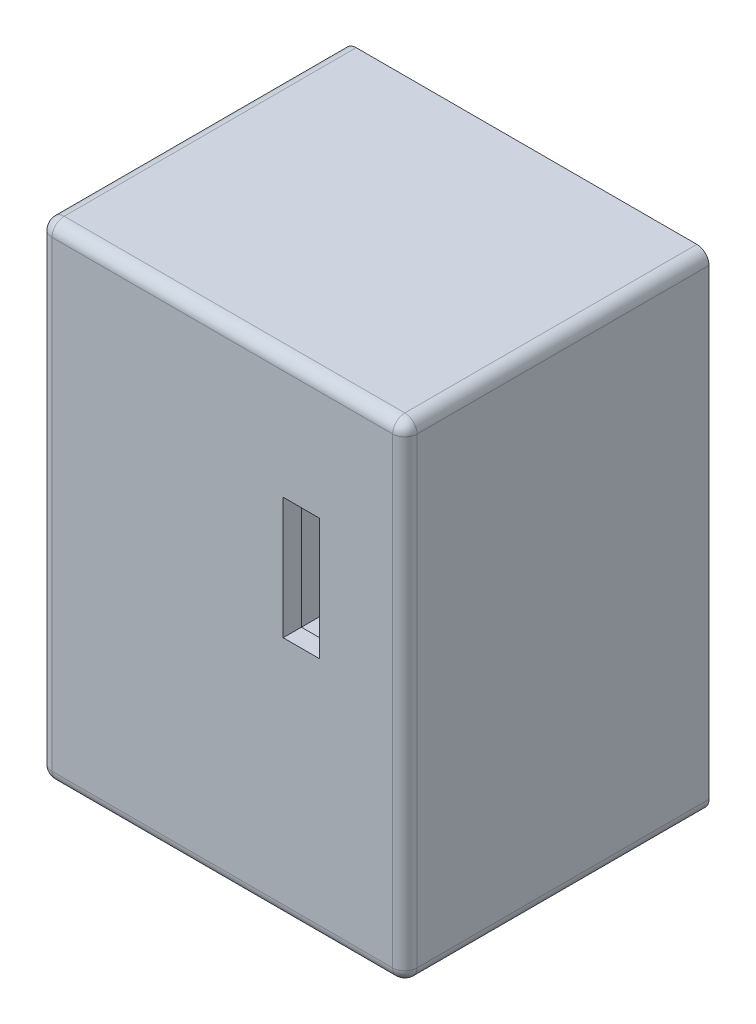
ISO-10303-21;
HEADER;
FILE_DESCRIPTION(('STEP AP214'),'2;1');
FILE_NAME('part.step','',(''),(''),'','','');
FILE_SCHEMA(('AUTOMOTIVE_DESIGN { 1 0 10303 214 1 1 1 1 }'));
ENDSEC;
DATA;
#1=APPLICATION_CONTEXT('core data for automotive mechanical design processes');
#2=APPLICATION_PROTOCOL_DEFINITION('international standard','automotive_design',2000,#1);
#3=PRODUCT_CONTEXT('',#1,'mechanical');
#4=PRODUCT('Part','Part','',(#3));
#5=PRODUCT_RELATED_PRODUCT_CATEGORY('part','',(#4));
#6=PRODUCT_DEFINITION_FORMATION('','',#4);
#7=PRODUCT_DEFINITION_CONTEXT('part definition',#1,'design');
#8=PRODUCT_DEFINITION('design','',#6,#7);
#9=PRODUCT_DEFINITION_SHAPE('','',#8);
#10=(LENGTH_UNIT() NAMED_UNIT(*) SI_UNIT(.MILLI.,.METRE.));
#11=(NAMED_UNIT(*) PLANE_ANGLE_UNIT() SI_UNIT($,.RADIAN.));
#12=(NAMED_UNIT(*) SI_UNIT($,.STERADIAN.) SOLID_ANGLE_UNIT());
#13=UNCERTAINTY_MEASURE_WITH_UNIT(LENGTH_MEASURE(1.E-05),#10,'distance_accuracy_value','');
#14=(GEOMETRIC_REPRESENTATION_CONTEXT(3) GLOBAL_UNCERTAINTY_ASSIGNED_CONTEXT((#13)) GLOBAL_UNIT_ASSIGNED_CONTEXT((#10,
#11,#12)) REPRESENTATION_CONTEXT('',''));
#15=CARTESIAN_POINT('',(0.,0.,0.));
#16=DIRECTION('',(0.,0.,1.));
#17=DIRECTION('',(1.,0.,0.));
#18=AXIS2_PLACEMENT_3D('',#15,#16,#17);
#19=CARTESIAN_POINT('',(0.,0.,0.));
#20=DIRECTION('',(0.,0.,-1.));
#21=DIRECTION('',(-1.,0.,0.));
#22=AXIS2_PLACEMENT_3D('',#19,#20,#21);
#23=PLANE('',#22);
#24=DIRECTION('',(0.,1.,0.));
#25=VECTOR('',#24,1.);
#26=CARTESIAN_POINT('',(30.,0.,0.));
#27=LINE('',#26,#25);
#28=CARTESIAN_POINT('',(30.,1.,0.));
#29=VERTEX_POINT('',#28);
#30=CARTESIAN_POINT('',(30.,39.,0.));
#31=VERTEX_POINT('',#30);
#32=EDGE_CURVE('E228',#29,#31,#27,.T.);
#33=ORIENTED_EDGE('',*,*,#32,.F.);
#34=CARTESIAN_POINT('',(29.,1.,0.));
#35=DIRECTION('',(0.,0.,-1.));
#36=DIRECTION('',(-1.,0.,0.));
#37=AXIS2_PLACEMENT_3D('',#34,#35,#36);
#38=CIRCLE('',#37,1.);
#39=CARTESIAN_POINT('',(29.,0.,0.));
#40=VERTEX_POINT('',#39);
#41=EDGE_CURVE('E288',#29,#40,#38,.T.);
#42=ORIENTED_EDGE('',*,*,#41,.T.);
#43=DIRECTION('',(1.,0.,0.));
#44=VECTOR('',#43,1.);
#45=CARTESIAN_POINT('',(0.,0.,0.));
#46=LINE('',#45,#44);
#47=CARTESIAN_POINT('',(1.,0.,0.));
#48=VERTEX_POINT('',#47);
#49=EDGE_CURVE('E231',#48,#40,#46,.T.);
#50=ORIENTED_EDGE('',*,*,#49,.F.);
#51=CARTESIAN_POINT('',(1.,1.,0.));
#52=DIRECTION('',(0.,0.,-1.));
#53=DIRECTION('',(-1.,0.,0.));
#54=AXIS2_PLACEMENT_3D('',#51,#52,#53);
#55=CIRCLE('',#54,1.);
#56=CARTESIAN_POINT('',(0.,1.,0.));
#57=VERTEX_POINT('',#56);
#58=EDGE_CURVE('E286',#48,#57,#55,.T.);
#59=ORIENTED_EDGE('',*,*,#58,.T.);
#60=DIRECTION('',(0.,1.,0.));
#61=VECTOR('',#60,1.);
#62=CARTESIAN_POINT('',(0.,0.,0.));
#63=LINE('',#62,#61);
#64=CARTESIAN_POINT('',(0.,39.,0.));
#65=VERTEX_POINT('',#64);
#66=EDGE_CURVE('E221',#57,#65,#63,.T.);
#67=ORIENTED_EDGE('',*,*,#66,.T.);
#68=CARTESIAN_POINT('',(0.99999999999999,39.,0.));
#69=DIRECTION('',(0.,0.,-1.));
#70=DIRECTION('',(-1.,0.,0.));
#71=AXIS2_PLACEMENT_3D('',#68,#69,#70);
#72=CIRCLE('',#71,1.);
#73=CARTESIAN_POINT('',(0.99999999999999,40.,0.));
#74=VERTEX_POINT('',#73);
#75=EDGE_CURVE('E284',#65,#74,#72,.T.);
#76=ORIENTED_EDGE('',*,*,#75,.T.);
#77=DIRECTION('',(1.,0.,0.));
#78=VECTOR('',#77,1.);
#79=CARTESIAN_POINT('',(0.,40.,0.));
#80=LINE('',#79,#78);
#81=CARTESIAN_POINT('',(29.,40.,0.));
#82=VERTEX_POINT('',#81);
#83=EDGE_CURVE('E224',#74,#82,#80,.T.);
#84=ORIENTED_EDGE('',*,*,#83,.T.);
#85=CARTESIAN_POINT('',(29.,39.,0.));
#86=DIRECTION('',(0.,0.,-1.));
#87=DIRECTION('',(-1.,0.,0.));
#88=AXIS2_PLACEMENT_3D('',#85,#86,#87);
#89=CIRCLE('',#88,1.);
#90=EDGE_CURVE('E282',#82,#31,#89,.T.);
#91=ORIENTED_EDGE('',*,*,#90,.T.);
#92=EDGE_LOOP('',(#33,#42,#50,#59,#67,#76,#84,#91));
#93=FACE_BOUND('',#92,.T.);
#94=DIRECTION('',(1.,0.,0.));
#95=VECTOR('',#94,1.);
#96=CARTESIAN_POINT('',(0.,1.5,0.));
#97=LINE('',#96,#95);
#98=CARTESIAN_POINT('',(1.5,1.5,0.));
#99=VERTEX_POINT('',#98);
#100=CARTESIAN_POINT('',(28.5,1.5,0.));
#101=VERTEX_POINT('',#100);
#102=EDGE_CURVE('E206',#99,#101,#97,.T.);
#103=ORIENTED_EDGE('',*,*,#102,.T.);
#104=DIRECTION('',(0.,1.,0.));
#105=VECTOR('',#104,1.);
#106=CARTESIAN_POINT('',(28.5,0.,0.));
#107=LINE('',#106,#105);
#108=CARTESIAN_POINT('',(28.5,38.5,0.));
#109=VERTEX_POINT('',#108);
#110=EDGE_CURVE('E216',#101,#109,#107,.T.);
#111=ORIENTED_EDGE('',*,*,#110,.T.);
#112=DIRECTION('',(1.,0.,0.));
#113=VECTOR('',#112,1.);
#114=CARTESIAN_POINT('',(0.,38.5,0.));
#115=LINE('',#114,#113);
#116=CARTESIAN_POINT('',(1.49999999999999,38.5,0.));
#117=VERTEX_POINT('',#116);
#118=EDGE_CURVE('E212',#117,#109,#115,.T.);
#119=ORIENTED_EDGE('',*,*,#118,.F.);
#120=DIRECTION('',(0.,1.,0.));
#121=VECTOR('',#120,1.);
#122=CARTESIAN_POINT('',(1.5,0.,0.));
#123=LINE('',#122,#121);
#124=EDGE_CURVE('E209',#99,#117,#123,.T.);
#125=ORIENTED_EDGE('',*,*,#124,.F.);
#126=EDGE_LOOP('',(#103,#111,#119,#125));
#127=FACE_BOUND('',#126,.T.);
#128=ADVANCED_FACE('F34',(#93,#127),#23,.T.);
#129=CARTESIAN_POINT('',(0.,0.,25.));
#130=DIRECTION('',(-1.,0.,0.));
#131=DIRECTION('',(0.,-1.,0.));
#132=AXIS2_PLACEMENT_3D('',#129,#130,#131);
#133=PLANE('',#132);
#134=ORIENTED_EDGE('',*,*,#66,.F.);
#135=DIRECTION('',(0.,0.,-1.));
#136=VECTOR('',#135,1.);
#137=CARTESIAN_POINT('',(0.,1.,24.));
#138=LINE('',#137,#136);
#139=CARTESIAN_POINT('',(0.,1.,24.));
#140=VERTEX_POINT('',#139);
#141=EDGE_CURVE('E296',#57,#140,#138,.F.);
#142=ORIENTED_EDGE('',*,*,#141,.T.);
#143=DIRECTION('',(0.,1.,0.));
#144=VECTOR('',#143,1.);
#145=CARTESIAN_POINT('',(0.,40.,24.));
#146=LINE('',#145,#144);
#147=CARTESIAN_POINT('',(0.,39.,24.));
#148=VERTEX_POINT('',#147);
#149=EDGE_CURVE('E252',#140,#148,#146,.T.);
#150=ORIENTED_EDGE('',*,*,#149,.T.);
#151=DIRECTION('',(0.,0.,-1.));
#152=VECTOR('',#151,1.);
#153=CARTESIAN_POINT('',(0.,39.,25.));
#154=LINE('',#153,#152);
#155=EDGE_CURVE('E294',#148,#65,#154,.T.);
#156=ORIENTED_EDGE('',*,*,#155,.T.);
#157=EDGE_LOOP('',(#134,#142,#150,#156));
#158=FACE_BOUND('',#157,.T.);
#159=ADVANCED_FACE('F361',(#158),#133,.T.);
#160=CARTESIAN_POINT('',(0.,0.,25.));
#161=DIRECTION('',(0.,1.,0.));
#162=DIRECTION('',(0.,0.,1.));
#163=AXIS2_PLACEMENT_3D('',#160,#161,#162);
#164=PLANE('',#163);
#165=ORIENTED_EDGE('',*,*,#49,.T.);
#166=DIRECTION('',(0.,0.,-1.));
#167=VECTOR('',#166,1.);
#168=CARTESIAN_POINT('',(29.,0.,25.));
#169=LINE('',#168,#167);
#170=CARTESIAN_POINT('',(29.,0.,24.));
#171=VERTEX_POINT('',#170);
#172=EDGE_CURVE('E292',#40,#171,#169,.F.);
#173=ORIENTED_EDGE('',*,*,#172,.T.);
#174=DIRECTION('',(1.,0.,0.));
#175=VECTOR('',#174,1.);
#176=CARTESIAN_POINT('',(0.,0.,24.));
#177=LINE('',#176,#175);
#178=CARTESIAN_POINT('',(1.,0.,24.));
#179=VERTEX_POINT('',#178);
#180=EDGE_CURVE('E246',#171,#179,#177,.F.);
#181=ORIENTED_EDGE('',*,*,#180,.T.);
#182=DIRECTION('',(0.,0.,-1.));
#183=VECTOR('',#182,1.);
#184=CARTESIAN_POINT('',(1.,0.,0.));
#185=LINE('',#184,#183);
#186=EDGE_CURVE('E290',#179,#48,#185,.T.);
#187=ORIENTED_EDGE('',*,*,#186,.T.);
#188=EDGE_LOOP('',(#165,#173,#181,#187));
#189=FACE_BOUND('',#188,.T.);
#190=ADVANCED_FACE('F367',(#189),#164,.F.);
#191=CARTESIAN_POINT('',(30.,0.,25.));
#192=DIRECTION('',(-1.,0.,0.));
#193=DIRECTION('',(0.,-1.,0.));
#194=AXIS2_PLACEMENT_3D('',#191,#192,#193);
#195=PLANE('',#194);
#196=DIRECTION('',(0.,1.,0.));
#197=VECTOR('',#196,1.);
#198=CARTESIAN_POINT('',(30.,0.,24.));
#199=LINE('',#198,#197);
#200=CARTESIAN_POINT('',(30.,39.,24.));
#201=VERTEX_POINT('',#200);
#202=CARTESIAN_POINT('',(30.,1.,24.));
#203=VERTEX_POINT('',#202);
#204=EDGE_CURVE('E249',#201,#203,#199,.F.);
#205=ORIENTED_EDGE('',*,*,#204,.T.);
#206=DIRECTION('',(0.,0.,-1.));
#207=VECTOR('',#206,1.);
#208=CARTESIAN_POINT('',(30.,1.,25.));
#209=LINE('',#208,#207);
#210=EDGE_CURVE('E280',#203,#29,#209,.T.);
#211=ORIENTED_EDGE('',*,*,#210,.T.);
#212=ORIENTED_EDGE('',*,*,#32,.T.);
#213=DIRECTION('',(0.,0.,-1.));
#214=VECTOR('',#213,1.);
#215=CARTESIAN_POINT('',(30.,39.,24.));
#216=LINE('',#215,#214);
#217=EDGE_CURVE('E278',#31,#201,#216,.F.);
#218=ORIENTED_EDGE('',*,*,#217,.T.);
#219=EDGE_LOOP('',(#205,#211,#212,#218));
#220=FACE_BOUND('',#219,.T.);
#221=ADVANCED_FACE('F377',(#220),#195,.F.);
#222=CARTESIAN_POINT('',(0.,40.,25.));
#223=DIRECTION('',(0.,1.,0.));
#224=DIRECTION('',(0.,0.,1.));
#225=AXIS2_PLACEMENT_3D('',#222,#223,#224);
#226=PLANE('',#225);
#227=ORIENTED_EDGE('',*,*,#83,.F.);
#228=DIRECTION('',(0.,0.,-1.));
#229=VECTOR('',#228,1.);
#230=CARTESIAN_POINT('',(0.99999999999999,40.,25.));
#231=LINE('',#230,#229);
#232=CARTESIAN_POINT('',(0.99999999999999,40.,24.));
#233=VERTEX_POINT('',#232);
#234=EDGE_CURVE('E300',#74,#233,#231,.F.);
#235=ORIENTED_EDGE('',*,*,#234,.T.);
#236=DIRECTION('',(1.,0.,0.));
#237=VECTOR('',#236,1.);
#238=CARTESIAN_POINT('',(30.,40.,24.));
#239=LINE('',#238,#237);
#240=CARTESIAN_POINT('',(29.,40.,24.));
#241=VERTEX_POINT('',#240);
#242=EDGE_CURVE('E255',#233,#241,#239,.T.);
#243=ORIENTED_EDGE('',*,*,#242,.T.);
#244=DIRECTION('',(0.,0.,-1.));
#245=VECTOR('',#244,1.);
#246=CARTESIAN_POINT('',(29.,40.,0.));
#247=LINE('',#246,#245);
#248=EDGE_CURVE('E298',#241,#82,#247,.T.);
#249=ORIENTED_EDGE('',*,*,#248,.T.);
#250=EDGE_LOOP('',(#227,#235,#243,#249));
#251=FACE_BOUND('',#250,.T.);
#252=ADVANCED_FACE('F381',(#251),#226,.T.);
#253=CARTESIAN_POINT('',(0.,0.,25.));
#254=DIRECTION('',(0.,0.,-1.));
#255=DIRECTION('',(-1.,0.,0.));
#256=AXIS2_PLACEMENT_3D('',#253,#254,#255);
#257=PLANE('',#256);
#258=DIRECTION('',(1.,0.,0.));
#259=VECTOR('',#258,1.);
#260=CARTESIAN_POINT('',(20.,20.,25.));
#261=LINE('',#260,#259);
#262=CARTESIAN_POINT('',(20.,20.,25.));
#263=VERTEX_POINT('',#262);
#264=CARTESIAN_POINT('',(23.,20.,25.));
#265=VERTEX_POINT('',#264);
#266=EDGE_CURVE('E182',#263,#265,#261,.T.);
#267=ORIENTED_EDGE('',*,*,#266,.F.);
#268=DIRECTION('',(0.,-1.,0.));
#269=VECTOR('',#268,1.);
#270=CARTESIAN_POINT('',(20.,30.,25.));
#271=LINE('',#270,#269);
#272=CARTESIAN_POINT('',(20.,30.,25.));
#273=VERTEX_POINT('',#272);
#274=EDGE_CURVE('E49',#273,#263,#271,.T.);
#275=ORIENTED_EDGE('',*,*,#274,.F.);
#276=DIRECTION('',(-1.,0.,0.));
#277=VECTOR('',#276,1.);
#278=CARTESIAN_POINT('',(20.,30.,25.));
#279=LINE('',#278,#277);
#280=CARTESIAN_POINT('',(23.,30.,25.));
#281=VERTEX_POINT('',#280);
#282=EDGE_CURVE('E189',#281,#273,#279,.T.);
#283=ORIENTED_EDGE('',*,*,#282,.F.);
#284=DIRECTION('',(0.,1.,0.));
#285=VECTOR('',#284,1.);
#286=CARTESIAN_POINT('',(23.,30.,25.));
#287=LINE('',#286,#285);
#288=EDGE_CURVE('E173',#265,#281,#287,.T.);
#289=ORIENTED_EDGE('',*,*,#288,.F.);
#290=EDGE_LOOP('',(#267,#275,#283,#289));
#291=FACE_BOUND('',#290,.T.);
#292=DIRECTION('',(0.,1.,0.));
#293=VECTOR('',#292,1.);
#294=CARTESIAN_POINT('',(1.,0.,25.));
#295=LINE('',#294,#293);
#296=CARTESIAN_POINT('',(0.99999999999999,39.,25.));
#297=VERTEX_POINT('',#296);
#298=CARTESIAN_POINT('',(1.,1.,25.));
#299=VERTEX_POINT('',#298);
#300=EDGE_CURVE('E237',#297,#299,#295,.F.);
#301=ORIENTED_EDGE('',*,*,#300,.T.);
#302=DIRECTION('',(1.,0.,0.));
#303=VECTOR('',#302,1.);
#304=CARTESIAN_POINT('',(0.,1.,25.));
#305=LINE('',#304,#303);
#306=CARTESIAN_POINT('',(29.,1.,25.));
#307=VERTEX_POINT('',#306);
#308=EDGE_CURVE('E243',#299,#307,#305,.T.);
#309=ORIENTED_EDGE('',*,*,#308,.T.);
#310=DIRECTION('',(0.,1.,0.));
#311=VECTOR('',#310,1.);
#312=CARTESIAN_POINT('',(29.,0.,25.));
#313=LINE('',#312,#311);
#314=CARTESIAN_POINT('',(29.,39.,25.));
#315=VERTEX_POINT('',#314);
#316=EDGE_CURVE('E240',#307,#315,#313,.T.);
#317=ORIENTED_EDGE('',*,*,#316,.T.);
#318=DIRECTION('',(1.,0.,0.));
#319=VECTOR('',#318,1.);
#320=CARTESIAN_POINT('',(0.,39.,25.));
#321=LINE('',#320,#319);
#322=EDGE_CURVE('E234',#315,#297,#321,.F.);
#323=ORIENTED_EDGE('',*,*,#322,.T.);
#324=EDGE_LOOP('',(#301,#309,#317,#323));
#325=FACE_BOUND('',#324,.T.);
#326=ADVANCED_FACE('F186',(#291,#325),#257,.F.);
#327=CARTESIAN_POINT('',(0.,39.,24.));
#328=DIRECTION('',(-1.,0.,0.));
#329=DIRECTION('',(0.,0.,1.));
#330=AXIS2_PLACEMENT_3D('',#327,#328,#329);
#331=CYLINDRICAL_SURFACE('',#330,1.);
#332=ORIENTED_EDGE('',*,*,#242,.F.);
#333=CARTESIAN_POINT('',(0.99999999999999,39.,24.));
#334=DIRECTION('',(-1.,0.,0.));
#335=DIRECTION('',(0.,0.,1.));
#336=AXIS2_PLACEMENT_3D('',#333,#334,#335);
#337=CIRCLE('',#336,1.);
#338=EDGE_CURVE('E276',#233,#297,#337,.F.);
#339=ORIENTED_EDGE('',*,*,#338,.T.);
#340=ORIENTED_EDGE('',*,*,#322,.F.);
#341=CARTESIAN_POINT('',(29.,39.,24.));
#342=DIRECTION('',(-1.,0.,0.));
#343=DIRECTION('',(0.,0.,1.));
#344=AXIS2_PLACEMENT_3D('',#341,#342,#343);
#345=CIRCLE('',#344,1.);
#346=EDGE_CURVE('E274',#315,#241,#345,.T.);
#347=ORIENTED_EDGE('',*,*,#346,.T.);
#348=EDGE_LOOP('',(#332,#339,#340,#347));
#349=FACE_BOUND('',#348,.T.);
#350=ADVANCED_FACE('F398',(#349),#331,.T.);
#351=CARTESIAN_POINT('',(1.,0.,24.));
#352=DIRECTION('',(0.,-1.,0.));
#353=DIRECTION('',(1.,0.,0.));
#354=AXIS2_PLACEMENT_3D('',#351,#352,#353);
#355=CYLINDRICAL_SURFACE('',#354,1.);
#356=ORIENTED_EDGE('',*,*,#149,.F.);
#357=CARTESIAN_POINT('',(1.,1.,24.));
#358=DIRECTION('',(0.,-1.,0.));
#359=DIRECTION('',(1.,0.,0.));
#360=AXIS2_PLACEMENT_3D('',#357,#358,#359);
#361=CIRCLE('',#360,1.);
#362=EDGE_CURVE('E272',#140,#299,#361,.F.);
#363=ORIENTED_EDGE('',*,*,#362,.T.);
#364=ORIENTED_EDGE('',*,*,#300,.F.);
#365=CARTESIAN_POINT('',(0.99999999999999,39.,24.));
#366=DIRECTION('',(0.,-1.,0.));
#367=DIRECTION('',(1.,0.,0.));
#368=AXIS2_PLACEMENT_3D('',#365,#366,#367);
#369=CIRCLE('',#368,1.);
#370=EDGE_CURVE('E269',#297,#148,#369,.T.);
#371=ORIENTED_EDGE('',*,*,#370,.T.);
#372=EDGE_LOOP('',(#356,#363,#364,#371));
#373=FACE_BOUND('',#372,.T.);
#374=ADVANCED_FACE('F394',(#373),#355,.T.);
#375=CARTESIAN_POINT('',(29.,0.,24.));
#376=DIRECTION('',(0.,1.,0.));
#377=DIRECTION('',(-1.,0.,0.));
#378=AXIS2_PLACEMENT_3D('',#375,#376,#377);
#379=CYLINDRICAL_SURFACE('',#378,1.);
#380=ORIENTED_EDGE('',*,*,#316,.F.);
#381=CARTESIAN_POINT('',(29.,1.,24.));
#382=DIRECTION('',(0.,1.,0.));
#383=DIRECTION('',(-1.,0.,0.));
#384=AXIS2_PLACEMENT_3D('',#381,#382,#383);
#385=CIRCLE('',#384,1.);
#386=EDGE_CURVE('E267',#307,#203,#385,.T.);
#387=ORIENTED_EDGE('',*,*,#386,.T.);
#388=ORIENTED_EDGE('',*,*,#204,.F.);
#389=CARTESIAN_POINT('',(29.,39.,24.));
#390=DIRECTION('',(0.,1.,0.));
#391=DIRECTION('',(-1.,0.,0.));
#392=AXIS2_PLACEMENT_3D('',#389,#390,#391);
#393=CIRCLE('',#392,1.);
#394=EDGE_CURVE('E264',#201,#315,#393,.F.);
#395=ORIENTED_EDGE('',*,*,#394,.T.);
#396=EDGE_LOOP('',(#380,#387,#388,#395));
#397=FACE_BOUND('',#396,.T.);
#398=ADVANCED_FACE('F390',(#397),#379,.T.);
#399=CARTESIAN_POINT('',(0.,1.,24.));
#400=DIRECTION('',(1.,0.,0.));
#401=DIRECTION('',(0.,0.,-1.));
#402=AXIS2_PLACEMENT_3D('',#399,#400,#401);
#403=CYLINDRICAL_SURFACE('',#402,1.);
#404=ORIENTED_EDGE('',*,*,#180,.F.);
#405=CARTESIAN_POINT('',(29.,1.,24.));
#406=DIRECTION('',(1.,0.,0.));
#407=DIRECTION('',(0.,0.,-1.));
#408=AXIS2_PLACEMENT_3D('',#405,#406,#407);
#409=CIRCLE('',#408,1.);
#410=EDGE_CURVE('E261',#171,#307,#409,.F.);
#411=ORIENTED_EDGE('',*,*,#410,.T.);
#412=ORIENTED_EDGE('',*,*,#308,.F.);
#413=CARTESIAN_POINT('',(1.,1.,24.));
#414=DIRECTION('',(1.,0.,0.));
#415=DIRECTION('',(0.,0.,-1.));
#416=AXIS2_PLACEMENT_3D('',#413,#414,#415);
#417=CIRCLE('',#416,1.);
#418=EDGE_CURVE('E258',#299,#179,#417,.T.);
#419=ORIENTED_EDGE('',*,*,#418,.T.);
#420=EDGE_LOOP('',(#404,#411,#412,#419));
#421=FACE_BOUND('',#420,.T.);
#422=ADVANCED_FACE('F386',(#421),#403,.T.);
#423=CARTESIAN_POINT('',(29.,1.,25.));
#424=DIRECTION('',(0.,0.,-1.));
#425=DIRECTION('',(-1.,0.,0.));
#426=AXIS2_PLACEMENT_3D('',#423,#424,#425);
#427=CYLINDRICAL_SURFACE('',#426,1.);
#428=ORIENTED_EDGE('',*,*,#41,.F.);
#429=ORIENTED_EDGE('',*,*,#210,.F.);
#430=CARTESIAN_POINT('',(29.,1.,24.));
#431=DIRECTION('',(0.,0.,1.));
#432=DIRECTION('',(1.,0.,0.));
#433=AXIS2_PLACEMENT_3D('',#430,#431,#432);
#434=CIRCLE('',#433,1.);
#435=EDGE_CURVE('E225',#171,#203,#434,.T.);
#436=ORIENTED_EDGE('',*,*,#435,.F.);
#437=ORIENTED_EDGE('',*,*,#172,.F.);
#438=EDGE_LOOP('',(#428,#429,#436,#437));
#439=FACE_BOUND('',#438,.T.);
#440=ADVANCED_FACE('F389',(#439),#427,.T.);
#441=CARTESIAN_POINT('',(29.,1.,24.));
#442=DIRECTION('',(0.,0.,1.));
#443=DIRECTION('',(1.,0.,0.));
#444=AXIS2_PLACEMENT_3D('',#441,#442,#443);
#445=SPHERICAL_SURFACE('',#444,1.);
#446=ORIENTED_EDGE('',*,*,#435,.T.);
#447=ORIENTED_EDGE('',*,*,#386,.F.);
#448=ORIENTED_EDGE('',*,*,#410,.F.);
#449=EDGE_LOOP('',(#446,#447,#448));
#450=FACE_BOUND('',#449,.T.);
#451=ADVANCED_FACE('F403',(#450),#445,.T.);
#452=CARTESIAN_POINT('',(1.,1.,25.));
#453=DIRECTION('',(0.,0.,1.));
#454=DIRECTION('',(1.,0.,0.));
#455=AXIS2_PLACEMENT_3D('',#452,#453,#454);
#456=CYLINDRICAL_SURFACE('',#455,1.);
#457=ORIENTED_EDGE('',*,*,#58,.F.);
#458=ORIENTED_EDGE('',*,*,#186,.F.);
#459=CARTESIAN_POINT('',(1.,1.,24.));
#460=DIRECTION('',(0.,0.,1.));
#461=DIRECTION('',(1.,0.,0.));
#462=AXIS2_PLACEMENT_3D('',#459,#460,#461);
#463=CIRCLE('',#462,1.);
#464=EDGE_CURVE('E305',#140,#179,#463,.T.);
#465=ORIENTED_EDGE('',*,*,#464,.F.);
#466=ORIENTED_EDGE('',*,*,#141,.F.);
#467=EDGE_LOOP('',(#457,#458,#465,#466));
#468=FACE_BOUND('',#467,.T.);
#469=ADVANCED_FACE('F406',(#468),#456,.T.);
#470=CARTESIAN_POINT('',(1.,1.,24.));
#471=DIRECTION('',(0.,0.,1.));
#472=DIRECTION('',(1.,0.,0.));
#473=AXIS2_PLACEMENT_3D('',#470,#471,#472);
#474=SPHERICAL_SURFACE('',#473,1.);
#475=ORIENTED_EDGE('',*,*,#418,.F.);
#476=ORIENTED_EDGE('',*,*,#362,.F.);
#477=ORIENTED_EDGE('',*,*,#464,.T.);
#478=EDGE_LOOP('',(#475,#476,#477));
#479=FACE_BOUND('',#478,.T.);
#480=ADVANCED_FACE('F411',(#479),#474,.T.);
#481=CARTESIAN_POINT('',(0.99999999999999,39.,25.));
#482=DIRECTION('',(0.,0.,-1.));
#483=DIRECTION('',(-1.,0.,0.));
#484=AXIS2_PLACEMENT_3D('',#481,#482,#483);
#485=CYLINDRICAL_SURFACE('',#484,1.);
#486=ORIENTED_EDGE('',*,*,#75,.F.);
#487=ORIENTED_EDGE('',*,*,#155,.F.);
#488=CARTESIAN_POINT('',(0.99999999999999,39.,24.));
#489=DIRECTION('',(0.,0.,1.));
#490=DIRECTION('',(1.,0.,0.));
#491=AXIS2_PLACEMENT_3D('',#488,#489,#490);
#492=CIRCLE('',#491,1.);
#493=EDGE_CURVE('E307',#233,#148,#492,.T.);
#494=ORIENTED_EDGE('',*,*,#493,.F.);
#495=ORIENTED_EDGE('',*,*,#234,.F.);
#496=EDGE_LOOP('',(#486,#487,#494,#495));
#497=FACE_BOUND('',#496,.T.);
#498=ADVANCED_FACE('F414',(#497),#485,.T.);
#499=CARTESIAN_POINT('',(0.99999999999999,39.,24.));
#500=DIRECTION('',(0.,0.,1.));
#501=DIRECTION('',(1.,0.,0.));
#502=AXIS2_PLACEMENT_3D('',#499,#500,#501);
#503=SPHERICAL_SURFACE('',#502,1.);
#504=ORIENTED_EDGE('',*,*,#370,.F.);
#505=ORIENTED_EDGE('',*,*,#338,.F.);
#506=ORIENTED_EDGE('',*,*,#493,.T.);
#507=EDGE_LOOP('',(#504,#505,#506));
#508=FACE_BOUND('',#507,.T.);
#509=ADVANCED_FACE('F419',(#508),#503,.T.);
#510=CARTESIAN_POINT('',(29.,39.,25.));
#511=DIRECTION('',(0.,0.,1.));
#512=DIRECTION('',(1.,0.,0.));
#513=AXIS2_PLACEMENT_3D('',#510,#511,#512);
#514=CYLINDRICAL_SURFACE('',#513,1.);
#515=ORIENTED_EDGE('',*,*,#90,.F.);
#516=ORIENTED_EDGE('',*,*,#248,.F.);
#517=CARTESIAN_POINT('',(29.,39.,24.));
#518=DIRECTION('',(0.,0.,1.));
#519=DIRECTION('',(1.,0.,0.));
#520=AXIS2_PLACEMENT_3D('',#517,#518,#519);
#521=CIRCLE('',#520,1.);
#522=EDGE_CURVE('E208',#201,#241,#521,.T.);
#523=ORIENTED_EDGE('',*,*,#522,.F.);
#524=ORIENTED_EDGE('',*,*,#217,.F.);
#525=EDGE_LOOP('',(#515,#516,#523,#524));
#526=FACE_BOUND('',#525,.T.);
#527=ADVANCED_FACE('F422',(#526),#514,.T.);
#528=CARTESIAN_POINT('',(29.,39.,24.));
#529=DIRECTION('',(0.,0.,1.));
#530=DIRECTION('',(1.,0.,0.));
#531=AXIS2_PLACEMENT_3D('',#528,#529,#530);
#532=SPHERICAL_SURFACE('',#531,1.);
#533=ORIENTED_EDGE('',*,*,#522,.T.);
#534=ORIENTED_EDGE('',*,*,#346,.F.);
#535=ORIENTED_EDGE('',*,*,#394,.F.);
#536=EDGE_LOOP('',(#533,#534,#535));
#537=FACE_BOUND('',#536,.T.);
#538=ADVANCED_FACE('F427',(#537),#532,.T.);
#539=CARTESIAN_POINT('',(1.5,0.,25.));
#540=DIRECTION('',(-1.,0.,0.));
#541=DIRECTION('',(0.,-1.,0.));
#542=AXIS2_PLACEMENT_3D('',#539,#540,#541);
#543=PLANE('',#542);
#544=DIRECTION('',(0.,0.,-1.));
#545=VECTOR('',#544,1.);
#546=CARTESIAN_POINT('',(1.49999999999999,38.5,25.));
#547=LINE('',#546,#545);
#548=CARTESIAN_POINT('',(1.49999999999999,38.5,22.5));
#549=VERTEX_POINT('',#548);
#550=EDGE_CURVE('E201',#549,#117,#547,.T.);
#551=ORIENTED_EDGE('',*,*,#550,.F.);
#552=DIRECTION('',(0.,-1.,0.));
#553=VECTOR('',#552,1.);
#554=CARTESIAN_POINT('',(1.5,0.,22.5));
#555=LINE('',#554,#553);
#556=CARTESIAN_POINT('',(1.5,1.5,22.5));
#557=VERTEX_POINT('',#556);
#558=EDGE_CURVE('E326',#549,#557,#555,.T.);
#559=ORIENTED_EDGE('',*,*,#558,.T.);
#560=DIRECTION('',(0.,0.,-1.));
#561=VECTOR('',#560,1.);
#562=CARTESIAN_POINT('',(1.5,1.5,25.));
#563=LINE('',#562,#561);
#564=EDGE_CURVE('E199',#557,#99,#563,.T.);
#565=ORIENTED_EDGE('',*,*,#564,.T.);
#566=ORIENTED_EDGE('',*,*,#124,.T.);
#567=EDGE_LOOP('',(#551,#559,#565,#566));
#568=FACE_BOUND('',#567,.T.);
#569=ADVANCED_FACE('F430',(#568),#543,.F.);
#570=CARTESIAN_POINT('',(0.,1.5,25.));
#571=DIRECTION('',(0.,1.,0.));
#572=DIRECTION('',(0.,0.,1.));
#573=AXIS2_PLACEMENT_3D('',#570,#571,#572);
#574=PLANE('',#573);
#575=ORIENTED_EDGE('',*,*,#564,.F.);
#576=DIRECTION('',(1.,0.,0.));
#577=VECTOR('',#576,1.);
#578=CARTESIAN_POINT('',(28.5,1.5,22.5));
#579=LINE('',#578,#577);
#580=CARTESIAN_POINT('',(28.5,1.5,22.5));
#581=VERTEX_POINT('',#580);
#582=EDGE_CURVE('E322',#557,#581,#579,.T.);
#583=ORIENTED_EDGE('',*,*,#582,.T.);
#584=DIRECTION('',(0.,0.,-1.));
#585=VECTOR('',#584,1.);
#586=CARTESIAN_POINT('',(28.5,1.5,25.));
#587=LINE('',#586,#585);
#588=EDGE_CURVE('E202',#581,#101,#587,.T.);
#589=ORIENTED_EDGE('',*,*,#588,.T.);
#590=ORIENTED_EDGE('',*,*,#102,.F.);
#591=EDGE_LOOP('',(#575,#583,#589,#590));
#592=FACE_BOUND('',#591,.T.);
#593=ADVANCED_FACE('F470',(#592),#574,.T.);
#594=CARTESIAN_POINT('',(28.5,0.,25.));
#595=DIRECTION('',(-1.,0.,0.));
#596=DIRECTION('',(0.,-1.,0.));
#597=AXIS2_PLACEMENT_3D('',#594,#595,#596);
#598=PLANE('',#597);
#599=ORIENTED_EDGE('',*,*,#588,.F.);
#600=DIRECTION('',(0.,-1.,0.));
#601=VECTOR('',#600,1.);
#602=CARTESIAN_POINT('',(28.5,38.5,22.5));
#603=LINE('',#602,#601);
#604=CARTESIAN_POINT('',(28.5,38.5,22.5));
#605=VERTEX_POINT('',#604);
#606=EDGE_CURVE('E324',#581,#605,#603,.F.);
#607=ORIENTED_EDGE('',*,*,#606,.T.);
#608=DIRECTION('',(0.,0.,-1.));
#609=VECTOR('',#608,1.);
#610=CARTESIAN_POINT('',(28.5,38.5,25.));
#611=LINE('',#610,#609);
#612=EDGE_CURVE('E204',#605,#109,#611,.T.);
#613=ORIENTED_EDGE('',*,*,#612,.T.);
#614=ORIENTED_EDGE('',*,*,#110,.F.);
#615=EDGE_LOOP('',(#599,#607,#613,#614));
#616=FACE_BOUND('',#615,.T.);
#617=ADVANCED_FACE('F468',(#616),#598,.T.);
#618=CARTESIAN_POINT('',(0.,38.5,25.));
#619=DIRECTION('',(0.,1.,0.));
#620=DIRECTION('',(0.,0.,1.));
#621=AXIS2_PLACEMENT_3D('',#618,#619,#620);
#622=PLANE('',#621);
#623=ORIENTED_EDGE('',*,*,#612,.F.);
#624=DIRECTION('',(-1.,0.,0.));
#625=VECTOR('',#624,1.);
#626=CARTESIAN_POINT('',(0.,38.5,22.5));
#627=LINE('',#626,#625);
#628=EDGE_CURVE('E302',#605,#549,#627,.T.);
#629=ORIENTED_EDGE('',*,*,#628,.T.);
#630=ORIENTED_EDGE('',*,*,#550,.T.);
#631=ORIENTED_EDGE('',*,*,#118,.T.);
#632=EDGE_LOOP('',(#623,#629,#630,#631));
#633=FACE_BOUND('',#632,.T.);
#634=ADVANCED_FACE('F461',(#633),#622,.F.);
#635=CARTESIAN_POINT('',(0.,0.,23.5));
#636=DIRECTION('',(0.,0.,-1.));
#637=DIRECTION('',(-1.,0.,0.));
#638=AXIS2_PLACEMENT_3D('',#635,#636,#637);
#639=PLANE('',#638);
#640=DIRECTION('',(0.,1.,0.));
#641=VECTOR('',#640,1.);
#642=CARTESIAN_POINT('',(20.,0.,23.5));
#643=LINE('',#642,#641);
#644=CARTESIAN_POINT('',(20.,20.,23.5));
#645=VERTEX_POINT('',#644);
#646=CARTESIAN_POINT('',(20.,30.,23.5));
#647=VERTEX_POINT('',#646);
#648=EDGE_CURVE('E11',#645,#647,#643,.T.);
#649=ORIENTED_EDGE('',*,*,#648,.F.);
#650=DIRECTION('',(-1.,0.,0.));
#651=VECTOR('',#650,1.);
#652=CARTESIAN_POINT('',(0.,20.,23.5));
#653=LINE('',#652,#651);
#654=CARTESIAN_POINT('',(23.,20.,23.5));
#655=VERTEX_POINT('',#654);
#656=EDGE_CURVE('E328',#655,#645,#653,.T.);
#657=ORIENTED_EDGE('',*,*,#656,.F.);
#658=DIRECTION('',(0.,-1.,0.));
#659=VECTOR('',#658,1.);
#660=CARTESIAN_POINT('',(23.,0.,23.5));
#661=LINE('',#660,#659);
#662=CARTESIAN_POINT('',(23.,30.,23.5));
#663=VERTEX_POINT('',#662);
#664=EDGE_CURVE('E176',#663,#655,#661,.T.);
#665=ORIENTED_EDGE('',*,*,#664,.F.);
#666=DIRECTION('',(1.,0.,0.));
#667=VECTOR('',#666,1.);
#668=CARTESIAN_POINT('',(0.,30.,23.5));
#669=LINE('',#668,#667);
#670=EDGE_CURVE('E42',#647,#663,#669,.T.);
#671=ORIENTED_EDGE('',*,*,#670,.F.);
#672=EDGE_LOOP('',(#649,#657,#665,#671));
#673=FACE_BOUND('',#672,.T.);
#674=DIRECTION('',(-1.,0.,0.));
#675=VECTOR('',#674,1.);
#676=CARTESIAN_POINT('',(0.,37.5,23.5));
#677=LINE('',#676,#675);
#678=CARTESIAN_POINT('',(2.49999999999999,37.5,23.5));
#679=VERTEX_POINT('',#678);
#680=CARTESIAN_POINT('',(27.5,37.5,23.5));
#681=VERTEX_POINT('',#680);
#682=EDGE_CURVE('E317',#679,#681,#677,.F.);
#683=ORIENTED_EDGE('',*,*,#682,.T.);
#684=DIRECTION('',(0.,-1.,0.));
#685=VECTOR('',#684,1.);
#686=CARTESIAN_POINT('',(27.5,1.5,23.5));
#687=LINE('',#686,#685);
#688=CARTESIAN_POINT('',(27.5,2.5,23.5));
#689=VERTEX_POINT('',#688);
#690=EDGE_CURVE('E320',#681,#689,#687,.T.);
#691=ORIENTED_EDGE('',*,*,#690,.T.);
#692=DIRECTION('',(1.,0.,0.));
#693=VECTOR('',#692,1.);
#694=CARTESIAN_POINT('',(1.5,2.5,23.5));
#695=LINE('',#694,#693);
#696=CARTESIAN_POINT('',(2.5,2.5,23.5));
#697=VERTEX_POINT('',#696);
#698=EDGE_CURVE('E315',#689,#697,#695,.F.);
#699=ORIENTED_EDGE('',*,*,#698,.T.);
#700=DIRECTION('',(0.,-1.,0.));
#701=VECTOR('',#700,1.);
#702=CARTESIAN_POINT('',(2.5,0.,23.5));
#703=LINE('',#702,#701);
#704=EDGE_CURVE('E313',#697,#679,#703,.F.);
#705=ORIENTED_EDGE('',*,*,#704,.T.);
#706=EDGE_LOOP('',(#683,#691,#699,#705));
#707=FACE_BOUND('',#706,.T.);
#708=ADVANCED_FACE('F344',(#673,#707),#639,.T.);
#709=CARTESIAN_POINT('',(0.,2.5,22.5));
#710=DIRECTION('',(-1.,0.,0.));
#711=DIRECTION('',(0.,0.,1.));
#712=AXIS2_PLACEMENT_3D('',#709,#710,#711);
#713=CYLINDRICAL_SURFACE('',#712,1.);
#714=CARTESIAN_POINT('',(2.5,2.5,22.5));
#715=DIRECTION('',(-0.707106781186548,0.707106781186547,0.));
#716=DIRECTION('',(-0.707106781186547,-0.707106781186548,0.));
#717=AXIS2_PLACEMENT_3D('',#714,#715,#716);
#718=ELLIPSE('',#717,1.41421356237309,1.);
#719=EDGE_CURVE('E332',#697,#557,#718,.F.);
#720=ORIENTED_EDGE('',*,*,#719,.F.);
#721=ORIENTED_EDGE('',*,*,#698,.F.);
#722=CARTESIAN_POINT('',(27.5,2.5,22.5));
#723=DIRECTION('',(-0.707106781186547,-0.707106781186548,0.));
#724=DIRECTION('',(-0.707106781186548,0.707106781186547,0.));
#725=AXIS2_PLACEMENT_3D('',#722,#723,#724);
#726=ELLIPSE('',#725,1.4142135623731,1.);
#727=EDGE_CURVE('E213',#581,#689,#726,.T.);
#728=ORIENTED_EDGE('',*,*,#727,.F.);
#729=ORIENTED_EDGE('',*,*,#582,.F.);
#730=EDGE_LOOP('',(#720,#721,#728,#729));
#731=FACE_BOUND('',#730,.T.);
#732=ADVANCED_FACE('F36',(#731),#713,.F.);
#733=CARTESIAN_POINT('',(27.5,0.,22.5));
#734=DIRECTION('',(0.,1.,0.));
#735=DIRECTION('',(-1.,0.,0.));
#736=AXIS2_PLACEMENT_3D('',#733,#734,#735);
#737=CYLINDRICAL_SURFACE('',#736,1.);
#738=ORIENTED_EDGE('',*,*,#727,.T.);
#739=ORIENTED_EDGE('',*,*,#690,.F.);
#740=CARTESIAN_POINT('',(27.5,37.5,22.5));
#741=DIRECTION('',(-0.707106781186548,0.707106781186547,0.));
#742=DIRECTION('',(-0.707106781186547,-0.707106781186548,0.));
#743=AXIS2_PLACEMENT_3D('',#740,#741,#742);
#744=ELLIPSE('',#743,1.41421356237309,1.);
#745=EDGE_CURVE('E330',#605,#681,#744,.F.);
#746=ORIENTED_EDGE('',*,*,#745,.F.);
#747=ORIENTED_EDGE('',*,*,#606,.F.);
#748=EDGE_LOOP('',(#738,#739,#746,#747));
#749=FACE_BOUND('',#748,.T.);
#750=ADVANCED_FACE('F436',(#749),#737,.F.);
#751=CARTESIAN_POINT('',(2.5,0.,22.5));
#752=DIRECTION('',(0.,-1.,0.));
#753=DIRECTION('',(1.,0.,0.));
#754=AXIS2_PLACEMENT_3D('',#751,#752,#753);
#755=CYLINDRICAL_SURFACE('',#754,1.);
#756=ORIENTED_EDGE('',*,*,#719,.T.);
#757=ORIENTED_EDGE('',*,*,#558,.F.);
#758=CARTESIAN_POINT('',(2.49999999999999,37.5,22.5));
#759=DIRECTION('',(-0.707106781186547,-0.707106781186548,0.));
#760=DIRECTION('',(-0.707106781186548,0.707106781186547,0.));
#761=AXIS2_PLACEMENT_3D('',#758,#759,#760);
#762=ELLIPSE('',#761,1.4142135623731,1.);
#763=EDGE_CURVE('E196',#679,#549,#762,.T.);
#764=ORIENTED_EDGE('',*,*,#763,.F.);
#765=ORIENTED_EDGE('',*,*,#704,.F.);
#766=EDGE_LOOP('',(#756,#757,#764,#765));
#767=FACE_BOUND('',#766,.T.);
#768=ADVANCED_FACE('F355',(#767),#755,.F.);
#769=CARTESIAN_POINT('',(0.,37.5,22.5));
#770=DIRECTION('',(-1.,0.,0.));
#771=DIRECTION('',(0.,0.,1.));
#772=AXIS2_PLACEMENT_3D('',#769,#770,#771);
#773=CYLINDRICAL_SURFACE('',#772,1.);
#774=ORIENTED_EDGE('',*,*,#745,.T.);
#775=ORIENTED_EDGE('',*,*,#682,.F.);
#776=ORIENTED_EDGE('',*,*,#763,.T.);
#777=ORIENTED_EDGE('',*,*,#628,.F.);
#778=EDGE_LOOP('',(#774,#775,#776,#777));
#779=FACE_BOUND('',#778,.T.);
#780=ADVANCED_FACE('F348',(#779),#773,.F.);
#781=CARTESIAN_POINT('',(20.,30.,0.));
#782=DIRECTION('',(-1.,0.,0.));
#783=DIRECTION('',(0.,0.,1.));
#784=AXIS2_PLACEMENT_3D('',#781,#782,#783);
#785=PLANE('',#784);
#786=ORIENTED_EDGE('',*,*,#648,.T.);
#787=DIRECTION('',(0.,0.,1.));
#788=VECTOR('',#787,1.);
#789=CARTESIAN_POINT('',(20.,30.,0.));
#790=LINE('',#789,#788);
#791=EDGE_CURVE('E194',#647,#273,#790,.T.);
#792=ORIENTED_EDGE('',*,*,#791,.T.);
#793=ORIENTED_EDGE('',*,*,#274,.T.);
#794=DIRECTION('',(0.,0.,1.));
#795=VECTOR('',#794,1.);
#796=CARTESIAN_POINT('',(20.,20.,0.));
#797=LINE('',#796,#795);
#798=EDGE_CURVE('E179',#645,#263,#797,.T.);
#799=ORIENTED_EDGE('',*,*,#798,.F.);
#800=EDGE_LOOP('',(#786,#792,#793,#799));
#801=FACE_BOUND('',#800,.T.);
#802=ADVANCED_FACE('F346',(#801),#785,.F.);
#803=CARTESIAN_POINT('',(20.,30.,0.));
#804=DIRECTION('',(0.,1.,0.));
#805=DIRECTION('',(0.,0.,1.));
#806=AXIS2_PLACEMENT_3D('',#803,#804,#805);
#807=PLANE('',#806);
#808=ORIENTED_EDGE('',*,*,#670,.T.);
#809=DIRECTION('',(0.,0.,1.));
#810=VECTOR('',#809,1.);
#811=CARTESIAN_POINT('',(23.,30.,0.));
#812=LINE('',#811,#810);
#813=EDGE_CURVE('E178',#663,#281,#812,.T.);
#814=ORIENTED_EDGE('',*,*,#813,.T.);
#815=ORIENTED_EDGE('',*,*,#282,.T.);
#816=ORIENTED_EDGE('',*,*,#791,.F.);
#817=EDGE_LOOP('',(#808,#814,#815,#816));
#818=FACE_BOUND('',#817,.T.);
#819=ADVANCED_FACE('F341',(#818),#807,.F.);
#820=CARTESIAN_POINT('',(23.,30.,0.));
#821=DIRECTION('',(1.,0.,0.));
#822=DIRECTION('',(0.,0.,-1.));
#823=AXIS2_PLACEMENT_3D('',#820,#821,#822);
#824=PLANE('',#823);
#825=ORIENTED_EDGE('',*,*,#664,.T.);
#826=DIRECTION('',(0.,0.,1.));
#827=VECTOR('',#826,1.);
#828=CARTESIAN_POINT('',(23.,20.,0.));
#829=LINE('',#828,#827);
#830=EDGE_CURVE('E57',#655,#265,#829,.T.);
#831=ORIENTED_EDGE('',*,*,#830,.T.);
#832=ORIENTED_EDGE('',*,*,#288,.T.);
#833=ORIENTED_EDGE('',*,*,#813,.F.);
#834=EDGE_LOOP('',(#825,#831,#832,#833));
#835=FACE_BOUND('',#834,.T.);
#836=ADVANCED_FACE('F170',(#835),#824,.F.);
#837=CARTESIAN_POINT('',(20.,20.,0.));
#838=DIRECTION('',(0.,-1.,0.));
#839=DIRECTION('',(0.,0.,-1.));
#840=AXIS2_PLACEMENT_3D('',#837,#838,#839);
#841=PLANE('',#840);
#842=ORIENTED_EDGE('',*,*,#656,.T.);
#843=ORIENTED_EDGE('',*,*,#798,.T.);
#844=ORIENTED_EDGE('',*,*,#266,.T.);
#845=ORIENTED_EDGE('',*,*,#830,.F.);
#846=EDGE_LOOP('',(#842,#843,#844,#845));
#847=FACE_BOUND('',#846,.T.);
#848=ADVANCED_FACE('F183',(#847),#841,.F.);
#849=CLOSED_SHELL('',(#128,#159,#190,#221,#252,#326,#350,#374,#398,#422,#440,#451,#469,#480,
#498,#509,#527,#538,#569,#593,#617,#634,#708,#732,#750,#768,#780,#802,#819,#836,#848));
#850=MANIFOLD_SOLID_BREP('B2',#849);
#851=ADVANCED_BREP_SHAPE_REPRESENTATION('',(#18,#850),#14);
#852=SHAPE_DEFINITION_REPRESENTATION(#9,#851);
ENDSEC;
END-ISO-10303-21;
